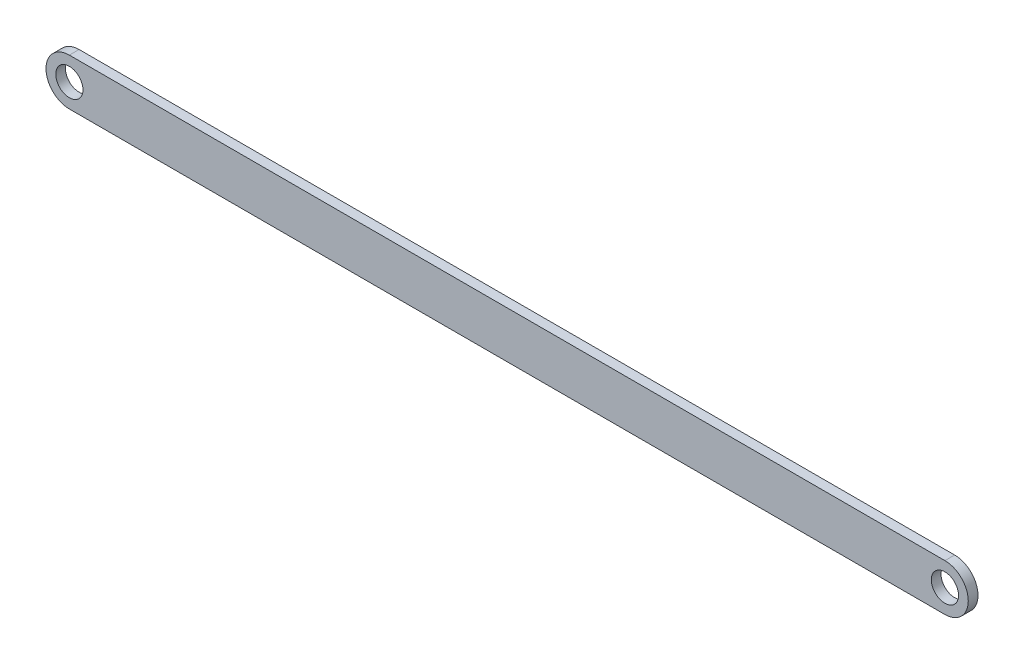
ISO-10303-21;
HEADER;
FILE_DESCRIPTION(('STEP AP214'),'2;1');
FILE_NAME('part.step','',(''),(''),'','','');
FILE_SCHEMA(('AUTOMOTIVE_DESIGN { 1 0 10303 214 1 1 1 1 }'));
ENDSEC;
DATA;
#1=APPLICATION_CONTEXT('core data for automotive mechanical design processes');
#2=APPLICATION_PROTOCOL_DEFINITION('international standard','automotive_design',2000,#1);
#3=PRODUCT_CONTEXT('',#1,'mechanical');
#4=PRODUCT('Part','Part','',(#3));
#5=PRODUCT_RELATED_PRODUCT_CATEGORY('part','',(#4));
#6=PRODUCT_DEFINITION_FORMATION('','',#4);
#7=PRODUCT_DEFINITION_CONTEXT('part definition',#1,'design');
#8=PRODUCT_DEFINITION('design','',#6,#7);
#9=PRODUCT_DEFINITION_SHAPE('','',#8);
#10=(LENGTH_UNIT() NAMED_UNIT(*) SI_UNIT(.MILLI.,.METRE.));
#11=(NAMED_UNIT(*) PLANE_ANGLE_UNIT() SI_UNIT($,.RADIAN.));
#12=(NAMED_UNIT(*) SI_UNIT($,.STERADIAN.) SOLID_ANGLE_UNIT());
#13=UNCERTAINTY_MEASURE_WITH_UNIT(LENGTH_MEASURE(1.E-05),#10,'distance_accuracy_value','');
#14=(GEOMETRIC_REPRESENTATION_CONTEXT(3) GLOBAL_UNCERTAINTY_ASSIGNED_CONTEXT((#13)) GLOBAL_UNIT_ASSIGNED_CONTEXT((#10,
#11,#12)) REPRESENTATION_CONTEXT('',''));
#15=CARTESIAN_POINT('',(0.,0.,0.));
#16=DIRECTION('',(0.,0.,1.));
#17=DIRECTION('',(1.,0.,0.));
#18=AXIS2_PLACEMENT_3D('',#15,#16,#17);
#19=CARTESIAN_POINT('',(0.,12.,5.));
#20=DIRECTION('',(0.,0.,-1.));
#21=DIRECTION('',(-1.,0.,0.));
#22=AXIS2_PLACEMENT_3D('',#19,#20,#21);
#23=CYLINDRICAL_SURFACE('',#22,12.);
#24=CARTESIAN_POINT('',(0.,12.,0.));
#25=DIRECTION('',(0.,0.,1.));
#26=DIRECTION('',(1.,0.,0.));
#27=AXIS2_PLACEMENT_3D('',#24,#25,#26);
#28=CIRCLE('',#27,12.);
#29=CARTESIAN_POINT('',(0.,24.,0.));
#30=VERTEX_POINT('',#29);
#31=CARTESIAN_POINT('',(0.,0.,0.));
#32=VERTEX_POINT('',#31);
#33=EDGE_CURVE('E107',#30,#32,#28,.T.);
#34=ORIENTED_EDGE('',*,*,#33,.T.);
#35=DIRECTION('',(0.,0.,-1.));
#36=VECTOR('',#35,1.);
#37=CARTESIAN_POINT('',(0.,0.,5.));
#38=LINE('',#37,#36);
#39=CARTESIAN_POINT('',(0.,0.,5.));
#40=VERTEX_POINT('',#39);
#41=EDGE_CURVE('E11',#40,#32,#38,.T.);
#42=ORIENTED_EDGE('',*,*,#41,.F.);
#43=CARTESIAN_POINT('',(0.,12.,5.));
#44=DIRECTION('',(0.,0.,1.));
#45=DIRECTION('',(1.,0.,0.));
#46=AXIS2_PLACEMENT_3D('',#43,#44,#45);
#47=CIRCLE('',#46,12.);
#48=CARTESIAN_POINT('',(0.,24.,5.));
#49=VERTEX_POINT('',#48);
#50=EDGE_CURVE('E91',#49,#40,#47,.T.);
#51=ORIENTED_EDGE('',*,*,#50,.F.);
#52=DIRECTION('',(0.,0.,-1.));
#53=VECTOR('',#52,1.);
#54=CARTESIAN_POINT('',(0.,24.,5.));
#55=LINE('',#54,#53);
#56=EDGE_CURVE('E103',#49,#30,#55,.T.);
#57=ORIENTED_EDGE('',*,*,#56,.T.);
#58=EDGE_LOOP('',(#34,#42,#51,#57));
#59=FACE_BOUND('',#58,.T.);
#60=ADVANCED_FACE('F39',(#59),#23,.T.);
#61=CARTESIAN_POINT('',(0.,0.,5.));
#62=DIRECTION('',(0.,1.,0.));
#63=DIRECTION('',(0.,0.,1.));
#64=AXIS2_PLACEMENT_3D('',#61,#62,#63);
#65=PLANE('',#64);
#66=DIRECTION('',(1.,0.,0.));
#67=VECTOR('',#66,1.);
#68=CARTESIAN_POINT('',(0.,0.,0.));
#69=LINE('',#68,#67);
#70=CARTESIAN_POINT('',(450.,0.,0.));
#71=VERTEX_POINT('',#70);
#72=EDGE_CURVE('E96',#32,#71,#69,.T.);
#73=ORIENTED_EDGE('',*,*,#72,.T.);
#74=DIRECTION('',(0.,0.,-1.));
#75=VECTOR('',#74,1.);
#76=CARTESIAN_POINT('',(450.,0.,5.));
#77=LINE('',#76,#75);
#78=CARTESIAN_POINT('',(450.,0.,5.));
#79=VERTEX_POINT('',#78);
#80=EDGE_CURVE('E48',#79,#71,#77,.T.);
#81=ORIENTED_EDGE('',*,*,#80,.F.);
#82=DIRECTION('',(1.,0.,0.));
#83=VECTOR('',#82,1.);
#84=CARTESIAN_POINT('',(0.,0.,5.));
#85=LINE('',#84,#83);
#86=EDGE_CURVE('E86',#40,#79,#85,.T.);
#87=ORIENTED_EDGE('',*,*,#86,.F.);
#88=ORIENTED_EDGE('',*,*,#41,.T.);
#89=EDGE_LOOP('',(#73,#81,#87,#88));
#90=FACE_BOUND('',#89,.T.);
#91=ADVANCED_FACE('F95',(#90),#65,.F.);
#92=CARTESIAN_POINT('',(450.,12.,5.));
#93=DIRECTION('',(0.,0.,-1.));
#94=DIRECTION('',(-1.,0.,0.));
#95=AXIS2_PLACEMENT_3D('',#92,#93,#94);
#96=CYLINDRICAL_SURFACE('',#95,12.);
#97=CARTESIAN_POINT('',(450.,12.,0.));
#98=DIRECTION('',(0.,0.,1.));
#99=DIRECTION('',(1.,0.,0.));
#100=AXIS2_PLACEMENT_3D('',#97,#98,#99);
#101=CIRCLE('',#100,12.);
#102=CARTESIAN_POINT('',(450.,24.,0.));
#103=VERTEX_POINT('',#102);
#104=EDGE_CURVE('E73',#71,#103,#101,.T.);
#105=ORIENTED_EDGE('',*,*,#104,.T.);
#106=DIRECTION('',(0.,0.,-1.));
#107=VECTOR('',#106,1.);
#108=CARTESIAN_POINT('',(450.,24.,5.));
#109=LINE('',#108,#107);
#110=CARTESIAN_POINT('',(450.,24.,5.));
#111=VERTEX_POINT('',#110);
#112=EDGE_CURVE('E98',#111,#103,#109,.T.);
#113=ORIENTED_EDGE('',*,*,#112,.F.);
#114=CARTESIAN_POINT('',(450.,12.,5.));
#115=DIRECTION('',(0.,0.,1.));
#116=DIRECTION('',(1.,0.,0.));
#117=AXIS2_PLACEMENT_3D('',#114,#115,#116);
#118=CIRCLE('',#117,12.);
#119=EDGE_CURVE('E89',#79,#111,#118,.T.);
#120=ORIENTED_EDGE('',*,*,#119,.F.);
#121=ORIENTED_EDGE('',*,*,#80,.T.);
#122=EDGE_LOOP('',(#105,#113,#120,#121));
#123=FACE_BOUND('',#122,.T.);
#124=ADVANCED_FACE('F99',(#123),#96,.T.);
#125=CARTESIAN_POINT('',(0.,24.,5.));
#126=DIRECTION('',(0.,-1.,0.));
#127=DIRECTION('',(0.,0.,-1.));
#128=AXIS2_PLACEMENT_3D('',#125,#126,#127);
#129=PLANE('',#128);
#130=DIRECTION('',(-1.,0.,0.));
#131=VECTOR('',#130,1.);
#132=CARTESIAN_POINT('',(0.,24.,0.));
#133=LINE('',#132,#131);
#134=EDGE_CURVE('E79',#103,#30,#133,.T.);
#135=ORIENTED_EDGE('',*,*,#134,.T.);
#136=ORIENTED_EDGE('',*,*,#56,.F.);
#137=DIRECTION('',(-1.,0.,0.));
#138=VECTOR('',#137,1.);
#139=CARTESIAN_POINT('',(0.,24.,5.));
#140=LINE('',#139,#138);
#141=EDGE_CURVE('E56',#111,#49,#140,.T.);
#142=ORIENTED_EDGE('',*,*,#141,.F.);
#143=ORIENTED_EDGE('',*,*,#112,.T.);
#144=EDGE_LOOP('',(#135,#136,#142,#143));
#145=FACE_BOUND('',#144,.T.);
#146=ADVANCED_FACE('F121',(#145),#129,.F.);
#147=CARTESIAN_POINT('',(0.,12.,5.));
#148=DIRECTION('',(0.,0.,1.));
#149=DIRECTION('',(1.,0.,0.));
#150=AXIS2_PLACEMENT_3D('',#147,#148,#149);
#151=PLANE('',#150);
#152=CARTESIAN_POINT('',(0.,12.,5.));
#153=DIRECTION('',(0.,0.,1.));
#154=DIRECTION('',(1.,0.,0.));
#155=AXIS2_PLACEMENT_3D('',#152,#153,#154);
#156=CIRCLE('',#155,7.);
#157=CARTESIAN_POINT('',(7.,12.,5.));
#158=VERTEX_POINT('',#157);
#159=EDGE_CURVE('E136',#158,#158,#156,.T.);
#160=ORIENTED_EDGE('',*,*,#159,.F.);
#161=EDGE_LOOP('',(#160));
#162=FACE_BOUND('',#161,.T.);
#163=CARTESIAN_POINT('',(450.,12.,5.));
#164=DIRECTION('',(0.,0.,1.));
#165=DIRECTION('',(1.,0.,0.));
#166=AXIS2_PLACEMENT_3D('',#163,#164,#165);
#167=CIRCLE('',#166,6.99999999999999);
#168=CARTESIAN_POINT('',(457.,12.,5.));
#169=VERTEX_POINT('',#168);
#170=EDGE_CURVE('E128',#169,#169,#167,.T.);
#171=ORIENTED_EDGE('',*,*,#170,.F.);
#172=EDGE_LOOP('',(#171));
#173=FACE_BOUND('',#172,.T.);
#174=ORIENTED_EDGE('',*,*,#50,.T.);
#175=ORIENTED_EDGE('',*,*,#86,.T.);
#176=ORIENTED_EDGE('',*,*,#119,.T.);
#177=ORIENTED_EDGE('',*,*,#141,.T.);
#178=EDGE_LOOP('',(#174,#175,#176,#177));
#179=FACE_BOUND('',#178,.T.);
#180=ADVANCED_FACE('F87',(#162,#173,#179),#151,.T.);
#181=CARTESIAN_POINT('',(0.,12.,0.));
#182=DIRECTION('',(0.,0.,1.));
#183=DIRECTION('',(1.,0.,0.));
#184=AXIS2_PLACEMENT_3D('',#181,#182,#183);
#185=PLANE('',#184);
#186=CARTESIAN_POINT('',(0.,12.,0.));
#187=DIRECTION('',(0.,0.,1.));
#188=DIRECTION('',(1.,0.,0.));
#189=AXIS2_PLACEMENT_3D('',#186,#187,#188);
#190=CIRCLE('',#189,7.);
#191=CARTESIAN_POINT('',(7.,12.,0.));
#192=VERTEX_POINT('',#191);
#193=EDGE_CURVE('E111',#192,#192,#190,.T.);
#194=ORIENTED_EDGE('',*,*,#193,.T.);
#195=EDGE_LOOP('',(#194));
#196=FACE_BOUND('',#195,.T.);
#197=CARTESIAN_POINT('',(450.,12.,0.));
#198=DIRECTION('',(0.,0.,1.));
#199=DIRECTION('',(1.,0.,0.));
#200=AXIS2_PLACEMENT_3D('',#197,#198,#199);
#201=CIRCLE('',#200,6.99999999999999);
#202=CARTESIAN_POINT('',(457.,12.,0.));
#203=VERTEX_POINT('',#202);
#204=EDGE_CURVE('E132',#203,#203,#201,.T.);
#205=ORIENTED_EDGE('',*,*,#204,.T.);
#206=EDGE_LOOP('',(#205));
#207=FACE_BOUND('',#206,.T.);
#208=ORIENTED_EDGE('',*,*,#33,.F.);
#209=ORIENTED_EDGE('',*,*,#134,.F.);
#210=ORIENTED_EDGE('',*,*,#104,.F.);
#211=ORIENTED_EDGE('',*,*,#72,.F.);
#212=EDGE_LOOP('',(#208,#209,#210,#211));
#213=FACE_BOUND('',#212,.T.);
#214=ADVANCED_FACE('F124',(#196,#207,#213),#185,.F.);
#215=CARTESIAN_POINT('',(450.,12.,0.));
#216=DIRECTION('',(0.,0.,1.));
#217=DIRECTION('',(1.,0.,0.));
#218=AXIS2_PLACEMENT_3D('',#215,#216,#217);
#219=CYLINDRICAL_SURFACE('',#218,6.99999999999999);
#220=ORIENTED_EDGE('',*,*,#204,.F.);
#221=EDGE_LOOP('',(#220));
#222=FACE_BOUND('',#221,.T.);
#223=ORIENTED_EDGE('',*,*,#170,.T.);
#224=EDGE_LOOP('',(#223));
#225=FACE_BOUND('',#224,.T.);
#226=ADVANCED_FACE('F149',(#222,#225),#219,.F.);
#227=CARTESIAN_POINT('',(0.,12.,0.));
#228=DIRECTION('',(0.,0.,1.));
#229=DIRECTION('',(1.,0.,0.));
#230=AXIS2_PLACEMENT_3D('',#227,#228,#229);
#231=CYLINDRICAL_SURFACE('',#230,7.);
#232=ORIENTED_EDGE('',*,*,#193,.F.);
#233=EDGE_LOOP('',(#232));
#234=FACE_BOUND('',#233,.T.);
#235=ORIENTED_EDGE('',*,*,#159,.T.);
#236=EDGE_LOOP('',(#235));
#237=FACE_BOUND('',#236,.T.);
#238=ADVANCED_FACE('F146',(#234,#237),#231,.F.);
#239=CLOSED_SHELL('',(#60,#91,#124,#146,#180,#214,#226,#238));
#240=MANIFOLD_SOLID_BREP('B2',#239);
#241=ADVANCED_BREP_SHAPE_REPRESENTATION('',(#18,#240),#14);
#242=SHAPE_DEFINITION_REPRESENTATION(#9,#241);
ENDSEC;
END-ISO-10303-21;
